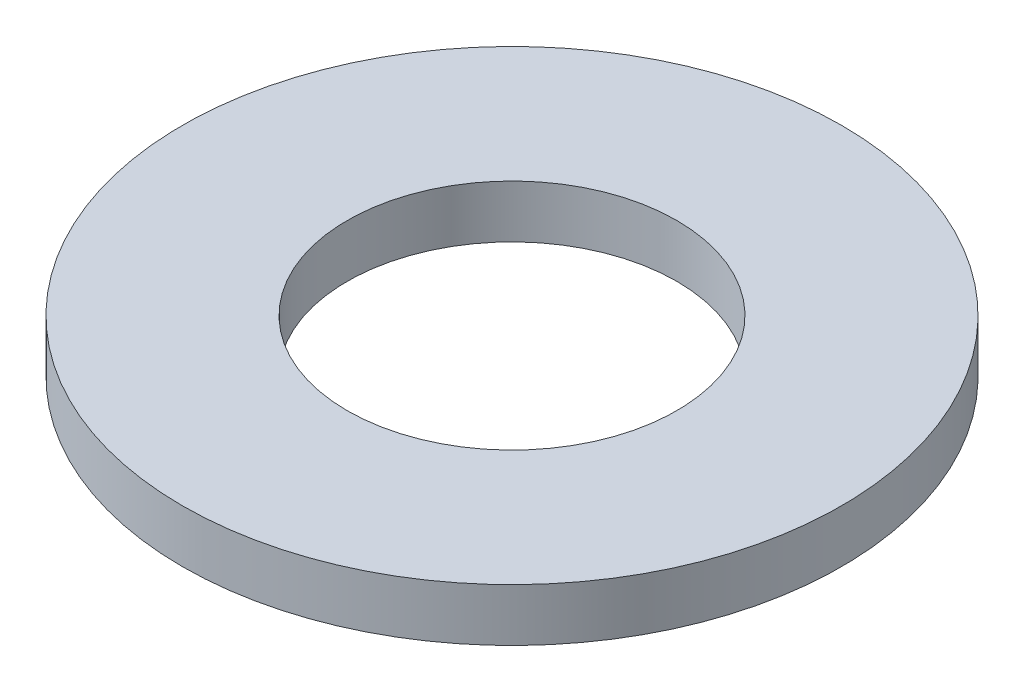
ISO-10303-21;
HEADER;
FILE_DESCRIPTION(('STEP AP214'),'2;1');
FILE_NAME('part.step','',(''),(''),'','','');
FILE_SCHEMA(('AUTOMOTIVE_DESIGN { 1 0 10303 214 1 1 1 1 }'));
ENDSEC;
DATA;
#1=APPLICATION_CONTEXT('core data for automotive mechanical design processes');
#2=APPLICATION_PROTOCOL_DEFINITION('international standard','automotive_design',2000,#1);
#3=PRODUCT_CONTEXT('',#1,'mechanical');
#4=PRODUCT('Part','Part','',(#3));
#5=PRODUCT_RELATED_PRODUCT_CATEGORY('part','',(#4));
#6=PRODUCT_DEFINITION_FORMATION('','',#4);
#7=PRODUCT_DEFINITION_CONTEXT('part definition',#1,'design');
#8=PRODUCT_DEFINITION('design','',#6,#7);
#9=PRODUCT_DEFINITION_SHAPE('','',#8);
#10=(LENGTH_UNIT() NAMED_UNIT(*) SI_UNIT(.MILLI.,.METRE.));
#11=(NAMED_UNIT(*) PLANE_ANGLE_UNIT() SI_UNIT($,.RADIAN.));
#12=(NAMED_UNIT(*) SI_UNIT($,.STERADIAN.) SOLID_ANGLE_UNIT());
#13=UNCERTAINTY_MEASURE_WITH_UNIT(LENGTH_MEASURE(1.E-05),#10,'distance_accuracy_value','');
#14=(GEOMETRIC_REPRESENTATION_CONTEXT(3) GLOBAL_UNCERTAINTY_ASSIGNED_CONTEXT((#13)) GLOBAL_UNIT_ASSIGNED_CONTEXT((#10,
#11,#12)) REPRESENTATION_CONTEXT('',''));
#15=CARTESIAN_POINT('',(0.,0.,0.));
#16=DIRECTION('',(0.,0.,1.));
#17=DIRECTION('',(1.,0.,0.));
#18=AXIS2_PLACEMENT_3D('',#15,#16,#17);
#19=CARTESIAN_POINT('',(0.,0.8,0.));
#20=DIRECTION('',(0.,1.,0.));
#21=DIRECTION('',(0.,0.,1.));
#22=AXIS2_PLACEMENT_3D('',#19,#20,#21);
#23=PLANE('',#22);
#24=CARTESIAN_POINT('',(0.,0.8,0.));
#25=DIRECTION('',(0.,1.,0.));
#26=DIRECTION('',(0.,0.,1.));
#27=AXIS2_PLACEMENT_3D('',#24,#25,#26);
#28=CIRCLE('',#27,5.);
#29=CARTESIAN_POINT('',(0.,0.8,5.));
#30=VERTEX_POINT('',#29);
#31=EDGE_CURVE('E10',#30,#30,#28,.T.);
#32=ORIENTED_EDGE('',*,*,#31,.T.);
#33=EDGE_LOOP('',(#32));
#34=FACE_BOUND('',#33,.T.);
#35=CARTESIAN_POINT('',(0.,0.8,0.));
#36=DIRECTION('',(0.,1.,0.));
#37=DIRECTION('',(0.,0.,1.));
#38=AXIS2_PLACEMENT_3D('',#35,#36,#37);
#39=CIRCLE('',#38,2.5);
#40=CARTESIAN_POINT('',(0.,0.8,2.5));
#41=VERTEX_POINT('',#40);
#42=EDGE_CURVE('E54',#41,#41,#39,.T.);
#43=ORIENTED_EDGE('',*,*,#42,.F.);
#44=EDGE_LOOP('',(#43));
#45=FACE_BOUND('',#44,.T.);
#46=ADVANCED_FACE('F41',(#34,#45),#23,.T.);
#47=CARTESIAN_POINT('',(0.,0.,0.));
#48=DIRECTION('',(0.,1.,0.));
#49=DIRECTION('',(0.,0.,1.));
#50=AXIS2_PLACEMENT_3D('',#47,#48,#49);
#51=PLANE('',#50);
#52=CARTESIAN_POINT('',(0.,0.,0.));
#53=DIRECTION('',(0.,1.,0.));
#54=DIRECTION('',(0.,0.,1.));
#55=AXIS2_PLACEMENT_3D('',#52,#53,#54);
#56=CIRCLE('',#55,5.);
#57=CARTESIAN_POINT('',(0.,0.,5.));
#58=VERTEX_POINT('',#57);
#59=EDGE_CURVE('E45',#58,#58,#56,.T.);
#60=ORIENTED_EDGE('',*,*,#59,.F.);
#61=EDGE_LOOP('',(#60));
#62=FACE_BOUND('',#61,.T.);
#63=CARTESIAN_POINT('',(0.,0.,0.));
#64=DIRECTION('',(0.,1.,0.));
#65=DIRECTION('',(0.,0.,1.));
#66=AXIS2_PLACEMENT_3D('',#63,#64,#65);
#67=CIRCLE('',#66,2.5);
#68=CARTESIAN_POINT('',(0.,0.,2.5));
#69=VERTEX_POINT('',#68);
#70=EDGE_CURVE('E56',#69,#69,#67,.T.);
#71=ORIENTED_EDGE('',*,*,#70,.T.);
#72=EDGE_LOOP('',(#71));
#73=FACE_BOUND('',#72,.T.);
#74=ADVANCED_FACE('F68',(#62,#73),#51,.F.);
#75=CARTESIAN_POINT('',(0.,0.8,0.));
#76=DIRECTION('',(0.,-1.,0.));
#77=DIRECTION('',(0.,0.,-1.));
#78=AXIS2_PLACEMENT_3D('',#75,#76,#77);
#79=CYLINDRICAL_SURFACE('',#78,5.);
#80=ORIENTED_EDGE('',*,*,#31,.F.);
#81=EDGE_LOOP('',(#80));
#82=FACE_BOUND('',#81,.T.);
#83=ORIENTED_EDGE('',*,*,#59,.T.);
#84=EDGE_LOOP('',(#83));
#85=FACE_BOUND('',#84,.T.);
#86=ADVANCED_FACE('F43',(#82,#85),#79,.T.);
#87=CARTESIAN_POINT('',(0.,0.8,0.));
#88=DIRECTION('',(0.,-1.,0.));
#89=DIRECTION('',(0.,0.,-1.));
#90=AXIS2_PLACEMENT_3D('',#87,#88,#89);
#91=CYLINDRICAL_SURFACE('',#90,2.5);
#92=ORIENTED_EDGE('',*,*,#42,.T.);
#93=EDGE_LOOP('',(#92));
#94=FACE_BOUND('',#93,.T.);
#95=ORIENTED_EDGE('',*,*,#70,.F.);
#96=EDGE_LOOP('',(#95));
#97=FACE_BOUND('',#96,.T.);
#98=ADVANCED_FACE('F64',(#94,#97),#91,.F.);
#99=CLOSED_SHELL('',(#46,#74,#86,#98));
#100=MANIFOLD_SOLID_BREP('B2',#99);
#101=ADVANCED_BREP_SHAPE_REPRESENTATION('',(#18,#100),#14);
#102=SHAPE_DEFINITION_REPRESENTATION(#9,#101);
ENDSEC;
END-ISO-10303-21;
